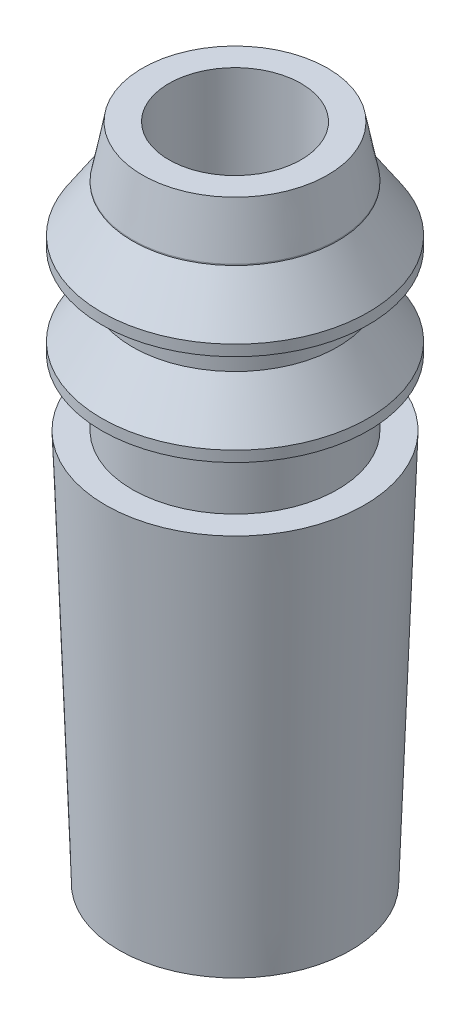
ISO-10303-21;
HEADER;
FILE_DESCRIPTION(('STEP AP214'),'2;1');
FILE_NAME('part.step','',(''),(''),'','','');
FILE_SCHEMA(('AUTOMOTIVE_DESIGN { 1 0 10303 214 1 1 1 1 }'));
ENDSEC;
DATA;
#1=APPLICATION_CONTEXT('core data for automotive mechanical design processes');
#2=APPLICATION_PROTOCOL_DEFINITION('international standard','automotive_design',2000,#1);
#3=PRODUCT_CONTEXT('',#1,'mechanical');
#4=PRODUCT('Part','Part','',(#3));
#5=PRODUCT_RELATED_PRODUCT_CATEGORY('part','',(#4));
#6=PRODUCT_DEFINITION_FORMATION('','',#4);
#7=PRODUCT_DEFINITION_CONTEXT('part definition',#1,'design');
#8=PRODUCT_DEFINITION('design','',#6,#7);
#9=PRODUCT_DEFINITION_SHAPE('','',#8);
#10=(LENGTH_UNIT() NAMED_UNIT(*) SI_UNIT(.MILLI.,.METRE.));
#11=(NAMED_UNIT(*) PLANE_ANGLE_UNIT() SI_UNIT($,.RADIAN.));
#12=(NAMED_UNIT(*) SI_UNIT($,.STERADIAN.) SOLID_ANGLE_UNIT());
#13=UNCERTAINTY_MEASURE_WITH_UNIT(LENGTH_MEASURE(1.E-05),#10,'distance_accuracy_value','');
#14=(GEOMETRIC_REPRESENTATION_CONTEXT(3) GLOBAL_UNCERTAINTY_ASSIGNED_CONTEXT((#13)) GLOBAL_UNIT_ASSIGNED_CONTEXT((#10,
#11,#12)) REPRESENTATION_CONTEXT('',''));
#15=CARTESIAN_POINT('',(0.,0.,0.));
#16=DIRECTION('',(0.,0.,1.));
#17=DIRECTION('',(1.,0.,0.));
#18=AXIS2_PLACEMENT_3D('',#15,#16,#17);
#19=CARTESIAN_POINT('',(0.,3.56,0.));
#20=DIRECTION('',(0.,1.,0.));
#21=DIRECTION('',(0.,0.,1.));
#22=AXIS2_PLACEMENT_3D('',#19,#20,#21);
#23=PLANE('',#22);
#24=CARTESIAN_POINT('',(0.,3.56,0.));
#25=DIRECTION('',(0.,1.,0.));
#26=DIRECTION('',(0.,0.,1.));
#27=AXIS2_PLACEMENT_3D('',#24,#25,#26);
#28=CIRCLE('',#27,1.17431793939058);
#29=CARTESIAN_POINT('',(0.,3.56,1.17431793939058));
#30=VERTEX_POINT('',#29);
#31=EDGE_CURVE('E47',#30,#30,#28,.T.);
#32=ORIENTED_EDGE('',*,*,#31,.T.);
#33=EDGE_LOOP('',(#32));
#34=FACE_BOUND('',#33,.T.);
#35=CARTESIAN_POINT('',(0.,3.56,0.));
#36=DIRECTION('',(0.,-1.,0.));
#37=DIRECTION('',(0.,0.,-1.));
#38=AXIS2_PLACEMENT_3D('',#35,#36,#37);
#39=CIRCLE('',#38,0.930249934423888);
#40=CARTESIAN_POINT('',(0.,3.56,-0.930249934423888));
#41=VERTEX_POINT('',#40);
#42=EDGE_CURVE('E55',#41,#41,#39,.T.);
#43=ORIENTED_EDGE('',*,*,#42,.T.);
#44=EDGE_LOOP('',(#43));
#45=FACE_BOUND('',#44,.T.);
#46=ADVANCED_FACE('F32',(#34,#45),#23,.T.);
#47=CARTESIAN_POINT('',(0.,0.,0.));
#48=DIRECTION('',(0.,1.,0.));
#49=DIRECTION('',(0.,0.,1.));
#50=AXIS2_PLACEMENT_3D('',#47,#48,#49);
#51=PLANE('',#50);
#52=CARTESIAN_POINT('',(0.,0.,0.));
#53=DIRECTION('',(0.,1.,0.));
#54=DIRECTION('',(0.,0.,1.));
#55=AXIS2_PLACEMENT_3D('',#52,#53,#54);
#56=CIRCLE('',#55,1.04999999999997);
#57=CARTESIAN_POINT('',(0.,0.,1.04999999999997));
#58=VERTEX_POINT('',#57);
#59=EDGE_CURVE('E43',#58,#58,#56,.F.);
#60=ORIENTED_EDGE('',*,*,#59,.T.);
#61=EDGE_LOOP('',(#60));
#62=FACE_BOUND('',#61,.T.);
#63=CARTESIAN_POINT('',(0.,0.,0.));
#64=DIRECTION('',(0.,1.,0.));
#65=DIRECTION('',(0.,0.,1.));
#66=AXIS2_PLACEMENT_3D('',#63,#64,#65);
#67=CIRCLE('',#66,0.6);
#68=CARTESIAN_POINT('',(0.,0.,0.6));
#69=VERTEX_POINT('',#68);
#70=EDGE_CURVE('E52',#69,#69,#67,.T.);
#71=ORIENTED_EDGE('',*,*,#70,.T.);
#72=EDGE_LOOP('',(#71));
#73=FACE_BOUND('',#72,.T.);
#74=ADVANCED_FACE('F139',(#62,#73),#51,.F.);
#75=CARTESIAN_POINT('',(0.,3.56,0.));
#76=DIRECTION('',(0.,-1.,0.));
#77=DIRECTION('',(0.,0.,-1.));
#78=AXIS2_PLACEMENT_3D('',#75,#76,#77);
#79=CYLINDRICAL_SURFACE('',#78,0.6);
#80=ORIENTED_EDGE('',*,*,#70,.F.);
#81=EDGE_LOOP('',(#80));
#82=FACE_BOUND('',#81,.T.);
#83=CARTESIAN_POINT('',(0.,5.98598157338806,0.));
#84=DIRECTION('',(0.,-1.,0.));
#85=DIRECTION('',(0.,0.,-1.));
#86=AXIS2_PLACEMENT_3D('',#83,#84,#85);
#87=CIRCLE('',#86,0.6);
#88=CARTESIAN_POINT('',(0.,5.98598157338806,-0.6));
#89=VERTEX_POINT('',#88);
#90=EDGE_CURVE('E58',#89,#89,#87,.T.);
#91=ORIENTED_EDGE('',*,*,#90,.F.);
#92=EDGE_LOOP('',(#91));
#93=FACE_BOUND('',#92,.T.);
#94=ADVANCED_FACE('F145',(#82,#93),#79,.F.);
#95=CARTESIAN_POINT('',(0.,4.29543799243863,0.));
#96=DIRECTION('',(0.,1.,0.));
#97=DIRECTION('',(0.,0.,1.));
#98=AXIS2_PLACEMENT_3D('',#95,#96,#97);
#99=CONICAL_SURFACE('',#98,1.2,0.0349065850398831);
#100=ORIENTED_EDGE('',*,*,#59,.F.);
#101=EDGE_LOOP('',(#100));
#102=FACE_BOUND('',#101,.T.);
#103=ORIENTED_EDGE('',*,*,#31,.F.);
#104=EDGE_LOOP('',(#103));
#105=FACE_BOUND('',#104,.T.);
#106=ADVANCED_FACE('F151',(#102,#105),#99,.T.);
#107=CARTESIAN_POINT('',(0.,3.56,0.));
#108=DIRECTION('',(0.,-1.,0.));
#109=DIRECTION('',(0.,0.,-1.));
#110=AXIS2_PLACEMENT_3D('',#107,#108,#109);
#111=CYLINDRICAL_SURFACE('',#110,0.93024993442389);
#112=ORIENTED_EDGE('',*,*,#42,.F.);
#113=EDGE_LOOP('',(#112));
#114=FACE_BOUND('',#113,.T.);
#115=CARTESIAN_POINT('',(0.,4.162806989164,0.));
#116=DIRECTION('',(0.,-1.,0.));
#117=DIRECTION('',(0.,0.,-1.));
#118=AXIS2_PLACEMENT_3D('',#115,#116,#117);
#119=CIRCLE('',#118,0.930249934423892);
#120=CARTESIAN_POINT('',(0.,4.162806989164,-0.930249934423892));
#121=VERTEX_POINT('',#120);
#122=EDGE_CURVE('E82',#121,#121,#119,.T.);
#123=ORIENTED_EDGE('',*,*,#122,.T.);
#124=EDGE_LOOP('',(#123));
#125=FACE_BOUND('',#124,.T.);
#126=ADVANCED_FACE('F86',(#114,#125),#111,.T.);
#127=CARTESIAN_POINT('',(-0.6,5.98598157338806,0.));
#128=DIRECTION('',(0.,-1.,0.));
#129=DIRECTION('',(0.,0.,-1.));
#130=AXIS2_PLACEMENT_3D('',#127,#128,#129);
#131=PLANE('',#130);
#132=CARTESIAN_POINT('',(0.,5.98598157338806,0.));
#133=DIRECTION('',(0.,-1.,0.));
#134=DIRECTION('',(0.,0.,-1.));
#135=AXIS2_PLACEMENT_3D('',#132,#133,#134);
#136=CIRCLE('',#135,0.840249934423897);
#137=CARTESIAN_POINT('',(0.,5.98598157338806,-0.840249934423897));
#138=VERTEX_POINT('',#137);
#139=EDGE_CURVE('E10',#138,#138,#136,.F.);
#140=ORIENTED_EDGE('',*,*,#139,.T.);
#141=EDGE_LOOP('',(#140));
#142=FACE_BOUND('',#141,.T.);
#143=ORIENTED_EDGE('',*,*,#90,.T.);
#144=EDGE_LOOP('',(#143));
#145=FACE_BOUND('',#144,.T.);
#146=ADVANCED_FACE('F132',(#142,#145),#131,.F.);
#147=CARTESIAN_POINT('',(0.,3.56,0.));
#148=DIRECTION('',(0.,-1.,0.));
#149=DIRECTION('',(0.,0.,-1.));
#150=AXIS2_PLACEMENT_3D('',#147,#148,#149);
#151=CYLINDRICAL_SURFACE('',#150,0.930249934423898);
#152=CARTESIAN_POINT('',(0.,5.52297171195072,0.));
#153=DIRECTION('',(0.,-1.,0.));
#154=DIRECTION('',(0.,0.,-1.));
#155=AXIS2_PLACEMENT_3D('',#152,#153,#154);
#156=CIRCLE('',#155,0.930249934423898);
#157=CARTESIAN_POINT('',(0.,5.52297171195072,-0.930249934423898));
#158=VERTEX_POINT('',#157);
#159=EDGE_CURVE('E39',#158,#158,#156,.T.);
#160=ORIENTED_EDGE('',*,*,#159,.T.);
#161=EDGE_LOOP('',(#160));
#162=FACE_BOUND('',#161,.T.);
#163=CARTESIAN_POINT('',(0.,5.51281860862094,0.));
#164=DIRECTION('',(0.,-1.,0.));
#165=DIRECTION('',(0.,0.,-1.));
#166=AXIS2_PLACEMENT_3D('',#163,#164,#165);
#167=CIRCLE('',#166,0.930249934423898);
#168=CARTESIAN_POINT('',(0.,5.51281860862094,-0.930249934423898));
#169=VERTEX_POINT('',#168);
#170=EDGE_CURVE('E61',#169,#169,#167,.T.);
#171=ORIENTED_EDGE('',*,*,#170,.F.);
#172=EDGE_LOOP('',(#171));
#173=FACE_BOUND('',#172,.T.);
#174=ADVANCED_FACE('F127',(#162,#173),#151,.T.);
#175=CARTESIAN_POINT('',(0.,5.51281860862094,0.));
#176=DIRECTION('',(0.,-1.,0.));
#177=DIRECTION('',(0.,0.,-1.));
#178=AXIS2_PLACEMENT_3D('',#175,#176,#177);
#179=CONICAL_SURFACE('',#178,0.930249934423898,0.587503692262525);
#180=CARTESIAN_POINT('',(0.,5.09283964323096,0.));
#181=DIRECTION('',(0.,-1.,0.));
#182=DIRECTION('',(0.,0.,-1.));
#183=AXIS2_PLACEMENT_3D('',#180,#181,#182);
#184=CIRCLE('',#183,1.20993335427053);
#185=CARTESIAN_POINT('',(0.,5.09283964323096,-1.20993335427053));
#186=VERTEX_POINT('',#185);
#187=EDGE_CURVE('E64',#186,#186,#184,.T.);
#188=ORIENTED_EDGE('',*,*,#187,.F.);
#189=EDGE_LOOP('',(#188));
#190=FACE_BOUND('',#189,.T.);
#191=ORIENTED_EDGE('',*,*,#170,.T.);
#192=EDGE_LOOP('',(#191));
#193=FACE_BOUND('',#192,.T.);
#194=ADVANCED_FACE('F121',(#190,#193),#179,.T.);
#195=CARTESIAN_POINT('',(0.,3.56,0.));
#196=DIRECTION('',(0.,-1.,0.));
#197=DIRECTION('',(0.,0.,-1.));
#198=AXIS2_PLACEMENT_3D('',#195,#196,#197);
#199=CYLINDRICAL_SURFACE('',#198,1.20993335427053);
#200=CARTESIAN_POINT('',(0.,4.99415058452982,0.));
#201=DIRECTION('',(0.,-1.,0.));
#202=DIRECTION('',(0.,0.,-1.));
#203=AXIS2_PLACEMENT_3D('',#200,#201,#202);
#204=CIRCLE('',#203,1.20993335427053);
#205=CARTESIAN_POINT('',(0.,4.99415058452982,-1.20993335427053));
#206=VERTEX_POINT('',#205);
#207=EDGE_CURVE('E67',#206,#206,#204,.T.);
#208=ORIENTED_EDGE('',*,*,#207,.F.);
#209=EDGE_LOOP('',(#208));
#210=FACE_BOUND('',#209,.T.);
#211=ORIENTED_EDGE('',*,*,#187,.T.);
#212=EDGE_LOOP('',(#211));
#213=FACE_BOUND('',#212,.T.);
#214=ADVANCED_FACE('F115',(#210,#213),#199,.T.);
#215=CARTESIAN_POINT('',(-1.20993335427053,4.99415058452982,0.));
#216=DIRECTION('',(0.,1.,0.));
#217=DIRECTION('',(0.,0.,1.));
#218=AXIS2_PLACEMENT_3D('',#215,#216,#217);
#219=PLANE('',#218);
#220=CARTESIAN_POINT('',(0.,4.99415058452982,0.));
#221=DIRECTION('',(0.,-1.,0.));
#222=DIRECTION('',(0.,0.,-1.));
#223=AXIS2_PLACEMENT_3D('',#220,#221,#222);
#224=CIRCLE('',#223,0.930249934423895);
#225=CARTESIAN_POINT('',(0.,4.99415058452982,-0.930249934423895));
#226=VERTEX_POINT('',#225);
#227=EDGE_CURVE('E70',#226,#226,#224,.T.);
#228=ORIENTED_EDGE('',*,*,#227,.F.);
#229=EDGE_LOOP('',(#228));
#230=FACE_BOUND('',#229,.T.);
#231=ORIENTED_EDGE('',*,*,#207,.T.);
#232=EDGE_LOOP('',(#231));
#233=FACE_BOUND('',#232,.T.);
#234=ADVANCED_FACE('F109',(#230,#233),#219,.F.);
#235=CARTESIAN_POINT('',(0.,3.56,0.));
#236=DIRECTION('',(0.,-1.,0.));
#237=DIRECTION('',(0.,0.,-1.));
#238=AXIS2_PLACEMENT_3D('',#235,#236,#237);
#239=CYLINDRICAL_SURFACE('',#238,0.930249934423895);
#240=CARTESIAN_POINT('',(0.,4.67997896538997,0.));
#241=DIRECTION('',(0.,-1.,0.));
#242=DIRECTION('',(0.,0.,-1.));
#243=AXIS2_PLACEMENT_3D('',#240,#241,#242);
#244=CIRCLE('',#243,0.930249934423895);
#245=CARTESIAN_POINT('',(0.,4.67997896538997,-0.930249934423895));
#246=VERTEX_POINT('',#245);
#247=EDGE_CURVE('E73',#246,#246,#244,.T.);
#248=ORIENTED_EDGE('',*,*,#247,.F.);
#249=EDGE_LOOP('',(#248));
#250=FACE_BOUND('',#249,.T.);
#251=ORIENTED_EDGE('',*,*,#227,.T.);
#252=EDGE_LOOP('',(#251));
#253=FACE_BOUND('',#252,.T.);
#254=ADVANCED_FACE('F103',(#250,#253),#239,.T.);
#255=CARTESIAN_POINT('',(0.,4.67997896538997,0.));
#256=DIRECTION('',(0.,-1.,0.));
#257=DIRECTION('',(0.,0.,-1.));
#258=AXIS2_PLACEMENT_3D('',#255,#256,#257);
#259=CONICAL_SURFACE('',#258,0.930249934423895,0.587503692262526);
#260=CARTESIAN_POINT('',(0.,4.26,0.));
#261=DIRECTION('',(0.,-1.,0.));
#262=DIRECTION('',(0.,0.,-1.));
#263=AXIS2_PLACEMENT_3D('',#260,#261,#262);
#264=CIRCLE('',#263,1.20993335427053);
#265=CARTESIAN_POINT('',(0.,4.26,-1.20993335427053));
#266=VERTEX_POINT('',#265);
#267=EDGE_CURVE('E76',#266,#266,#264,.T.);
#268=ORIENTED_EDGE('',*,*,#267,.F.);
#269=EDGE_LOOP('',(#268));
#270=FACE_BOUND('',#269,.T.);
#271=ORIENTED_EDGE('',*,*,#247,.T.);
#272=EDGE_LOOP('',(#271));
#273=FACE_BOUND('',#272,.T.);
#274=ADVANCED_FACE('F97',(#270,#273),#259,.T.);
#275=CARTESIAN_POINT('',(0.,3.56,0.));
#276=DIRECTION('',(0.,-1.,0.));
#277=DIRECTION('',(0.,0.,-1.));
#278=AXIS2_PLACEMENT_3D('',#275,#276,#277);
#279=CYLINDRICAL_SURFACE('',#278,1.20993335427053);
#280=CARTESIAN_POINT('',(0.,4.162806989164,0.));
#281=DIRECTION('',(0.,-1.,0.));
#282=DIRECTION('',(0.,0.,-1.));
#283=AXIS2_PLACEMENT_3D('',#280,#281,#282);
#284=CIRCLE('',#283,1.20993335427053);
#285=CARTESIAN_POINT('',(0.,4.162806989164,-1.20993335427053));
#286=VERTEX_POINT('',#285);
#287=EDGE_CURVE('E79',#286,#286,#284,.T.);
#288=ORIENTED_EDGE('',*,*,#287,.F.);
#289=EDGE_LOOP('',(#288));
#290=FACE_BOUND('',#289,.T.);
#291=ORIENTED_EDGE('',*,*,#267,.T.);
#292=EDGE_LOOP('',(#291));
#293=FACE_BOUND('',#292,.T.);
#294=ADVANCED_FACE('F91',(#290,#293),#279,.T.);
#295=CARTESIAN_POINT('',(-1.20993335427053,4.162806989164,0.));
#296=DIRECTION('',(0.,1.,0.));
#297=DIRECTION('',(0.,0.,1.));
#298=AXIS2_PLACEMENT_3D('',#295,#296,#297);
#299=PLANE('',#298);
#300=ORIENTED_EDGE('',*,*,#122,.F.);
#301=EDGE_LOOP('',(#300));
#302=FACE_BOUND('',#301,.T.);
#303=ORIENTED_EDGE('',*,*,#287,.T.);
#304=EDGE_LOOP('',(#303));
#305=FACE_BOUND('',#304,.T.);
#306=ADVANCED_FACE('F88',(#302,#305),#299,.F.);
#307=CARTESIAN_POINT('',(0.,5.52297171195072,0.));
#308=DIRECTION('',(0.,-1.,0.));
#309=DIRECTION('',(0.,0.,-1.));
#310=AXIS2_PLACEMENT_3D('',#307,#308,#309);
#311=CONICAL_SURFACE('',#310,0.930249934423898,0.191986217719374);
#312=ORIENTED_EDGE('',*,*,#139,.F.);
#313=EDGE_LOOP('',(#312));
#314=FACE_BOUND('',#313,.T.);
#315=ORIENTED_EDGE('',*,*,#159,.F.);
#316=EDGE_LOOP('',(#315));
#317=FACE_BOUND('',#316,.T.);
#318=ADVANCED_FACE('F34',(#314,#317),#311,.T.);
#319=CLOSED_SHELL('',(#46,#74,#94,#106,#126,#146,#174,#194,#214,#234,#254,#274,#294,#306,#318));
#320=MANIFOLD_SOLID_BREP('B2',#319);
#321=ADVANCED_BREP_SHAPE_REPRESENTATION('',(#18,#320),#14);
#322=SHAPE_DEFINITION_REPRESENTATION(#9,#321);
ENDSEC;
END-ISO-10303-21;
